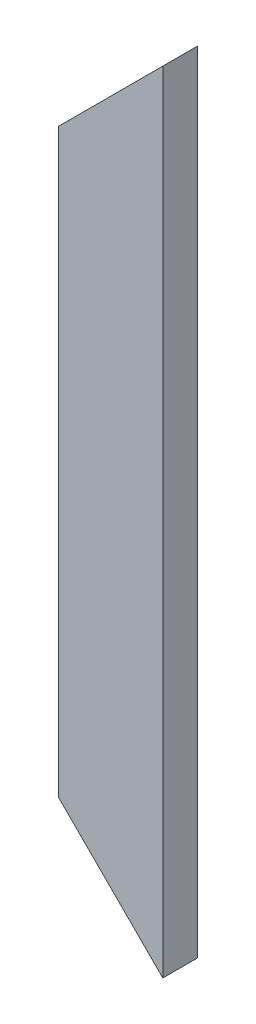
ISO-10303-21;
HEADER;
FILE_DESCRIPTION(('STEP AP214'),'2;1');
FILE_NAME('part.step','',(''),(''),'','','');
FILE_SCHEMA(('AUTOMOTIVE_DESIGN { 1 0 10303 214 1 1 1 1 }'));
ENDSEC;
DATA;
#1=APPLICATION_CONTEXT('core data for automotive mechanical design processes');
#2=APPLICATION_PROTOCOL_DEFINITION('international standard','automotive_design',2000,#1);
#3=PRODUCT_CONTEXT('',#1,'mechanical');
#4=PRODUCT('Part','Part','',(#3));
#5=PRODUCT_RELATED_PRODUCT_CATEGORY('part','',(#4));
#6=PRODUCT_DEFINITION_FORMATION('','',#4);
#7=PRODUCT_DEFINITION_CONTEXT('part definition',#1,'design');
#8=PRODUCT_DEFINITION('design','',#6,#7);
#9=PRODUCT_DEFINITION_SHAPE('','',#8);
#10=(LENGTH_UNIT() NAMED_UNIT(*) SI_UNIT(.MILLI.,.METRE.));
#11=(NAMED_UNIT(*) PLANE_ANGLE_UNIT() SI_UNIT($,.RADIAN.));
#12=(NAMED_UNIT(*) SI_UNIT($,.STERADIAN.) SOLID_ANGLE_UNIT());
#13=UNCERTAINTY_MEASURE_WITH_UNIT(LENGTH_MEASURE(1.E-05),#10,'distance_accuracy_value','');
#14=(GEOMETRIC_REPRESENTATION_CONTEXT(3) GLOBAL_UNCERTAINTY_ASSIGNED_CONTEXT((#13)) GLOBAL_UNIT_ASSIGNED_CONTEXT((#10,
#11,#12)) REPRESENTATION_CONTEXT('',''));
#15=CARTESIAN_POINT('',(0.,0.,0.));
#16=DIRECTION('',(0.,0.,1.));
#17=DIRECTION('',(1.,0.,0.));
#18=AXIS2_PLACEMENT_3D('',#15,#16,#17);
#19=CARTESIAN_POINT('',(-38.1,500.,-12.7));
#20=DIRECTION('',(1.,0.,0.));
#21=DIRECTION('',(0.,0.,-1.));
#22=AXIS2_PLACEMENT_3D('',#19,#20,#21);
#23=PLANE('',#22);
#24=DIRECTION('',(0.,-1.,0.));
#25=VECTOR('',#24,1.);
#26=CARTESIAN_POINT('',(-38.1,500.,12.7));
#27=LINE('',#26,#25);
#28=CARTESIAN_POINT('',(-38.1,461.9,12.7));
#29=VERTEX_POINT('',#28);
#30=CARTESIAN_POINT('',(-38.1,38.1,12.7));
#31=VERTEX_POINT('',#30);
#32=EDGE_CURVE('E11',#29,#31,#27,.T.);
#33=ORIENTED_EDGE('',*,*,#32,.F.);
#34=DIRECTION('',(0.,0.,-1.));
#35=VECTOR('',#34,1.);
#36=CARTESIAN_POINT('',(-38.1,461.9,-12.7));
#37=LINE('',#36,#35);
#38=CARTESIAN_POINT('',(-38.1,461.9,-12.7));
#39=VERTEX_POINT('',#38);
#40=EDGE_CURVE('E153',#29,#39,#37,.T.);
#41=ORIENTED_EDGE('',*,*,#40,.T.);
#42=DIRECTION('',(0.,-1.,0.));
#43=VECTOR('',#42,1.);
#44=CARTESIAN_POINT('',(-38.1,500.,-12.7));
#45=LINE('',#44,#43);
#46=CARTESIAN_POINT('',(-38.1,38.1,-12.7));
#47=VERTEX_POINT('',#46);
#48=EDGE_CURVE('E121',#39,#47,#45,.T.);
#49=ORIENTED_EDGE('',*,*,#48,.T.);
#50=DIRECTION('',(0.,0.,1.));
#51=VECTOR('',#50,1.);
#52=CARTESIAN_POINT('',(-38.1,38.1,-12.6999999999999));
#53=LINE('',#52,#51);
#54=EDGE_CURVE('E112',#47,#31,#53,.T.);
#55=ORIENTED_EDGE('',*,*,#54,.T.);
#56=EDGE_LOOP('',(#33,#41,#49,#55));
#57=FACE_BOUND('',#56,.T.);
#58=ADVANCED_FACE('F36',(#57),#23,.F.);
#59=CARTESIAN_POINT('',(-38.1,500.,12.7));
#60=DIRECTION('',(0.,0.,-1.));
#61=DIRECTION('',(-1.,0.,0.));
#62=AXIS2_PLACEMENT_3D('',#59,#60,#61);
#63=PLANE('',#62);
#64=DIRECTION('',(0.,-1.,0.));
#65=VECTOR('',#64,1.);
#66=CARTESIAN_POINT('',(38.1,500.,12.7));
#67=LINE('',#66,#65);
#68=CARTESIAN_POINT('',(38.1,538.1,12.7));
#69=VERTEX_POINT('',#68);
#70=CARTESIAN_POINT('',(38.1,-38.1,12.7));
#71=VERTEX_POINT('',#70);
#72=EDGE_CURVE('E43',#69,#71,#67,.T.);
#73=ORIENTED_EDGE('',*,*,#72,.F.);
#74=DIRECTION('',(-0.707106781186547,-0.707106781186548,0.));
#75=VECTOR('',#74,1.);
#76=CARTESIAN_POINT('',(-106.109011793753,393.890988206247,12.7));
#77=LINE('',#76,#75);
#78=EDGE_CURVE('E106',#69,#29,#77,.T.);
#79=ORIENTED_EDGE('',*,*,#78,.T.);
#80=ORIENTED_EDGE('',*,*,#32,.T.);
#81=DIRECTION('',(-0.707106781186548,0.707106781186547,0.));
#82=VECTOR('',#81,1.);
#83=CARTESIAN_POINT('',(-62.7726738542055,62.7726738542055,12.7));
#84=LINE('',#83,#82);
#85=EDGE_CURVE('E150',#71,#31,#84,.T.);
#86=ORIENTED_EDGE('',*,*,#85,.F.);
#87=EDGE_LOOP('',(#73,#79,#80,#86));
#88=FACE_BOUND('',#87,.T.);
#89=ADVANCED_FACE('F164',(#88),#63,.F.);
#90=CARTESIAN_POINT('',(38.1,500.,-12.7));
#91=DIRECTION('',(-1.,0.,0.));
#92=DIRECTION('',(0.,0.,1.));
#93=AXIS2_PLACEMENT_3D('',#90,#91,#92);
#94=PLANE('',#93);
#95=ORIENTED_EDGE('',*,*,#72,.T.);
#96=DIRECTION('',(0.,0.,1.));
#97=VECTOR('',#96,1.);
#98=CARTESIAN_POINT('',(38.1,-38.1,-12.7));
#99=LINE('',#98,#97);
#100=CARTESIAN_POINT('',(38.1,-38.1,-12.7));
#101=VERTEX_POINT('',#100);
#102=EDGE_CURVE('E111',#101,#71,#99,.T.);
#103=ORIENTED_EDGE('',*,*,#102,.F.);
#104=DIRECTION('',(0.,-1.,0.));
#105=VECTOR('',#104,1.);
#106=CARTESIAN_POINT('',(38.1,500.,-12.7));
#107=LINE('',#106,#105);
#108=CARTESIAN_POINT('',(38.1,538.1,-12.7));
#109=VERTEX_POINT('',#108);
#110=EDGE_CURVE('E119',#109,#101,#107,.T.);
#111=ORIENTED_EDGE('',*,*,#110,.F.);
#112=DIRECTION('',(0.,0.,-1.));
#113=VECTOR('',#112,1.);
#114=CARTESIAN_POINT('',(38.1,538.1,12.7));
#115=LINE('',#114,#113);
#116=EDGE_CURVE('E100',#69,#109,#115,.T.);
#117=ORIENTED_EDGE('',*,*,#116,.F.);
#118=EDGE_LOOP('',(#95,#103,#111,#117));
#119=FACE_BOUND('',#118,.T.);
#120=ADVANCED_FACE('F123',(#119),#94,.F.);
#121=CARTESIAN_POINT('',(-38.1,500.,-12.7));
#122=DIRECTION('',(0.,0.,1.));
#123=DIRECTION('',(1.,0.,0.));
#124=AXIS2_PLACEMENT_3D('',#121,#122,#123);
#125=PLANE('',#124);
#126=ORIENTED_EDGE('',*,*,#48,.F.);
#127=DIRECTION('',(-0.707106781186547,-0.707106781186548,0.));
#128=VECTOR('',#127,1.);
#129=CARTESIAN_POINT('',(-106.109011793753,393.890988206247,-12.7));
#130=LINE('',#129,#128);
#131=EDGE_CURVE('E103',#109,#39,#130,.T.);
#132=ORIENTED_EDGE('',*,*,#131,.F.);
#133=ORIENTED_EDGE('',*,*,#110,.T.);
#134=DIRECTION('',(-0.707106781186548,0.707106781186547,0.));
#135=VECTOR('',#134,1.);
#136=CARTESIAN_POINT('',(-62.7726738542055,62.7726738542055,-12.7));
#137=LINE('',#136,#135);
#138=EDGE_CURVE('E148',#101,#47,#137,.T.);
#139=ORIENTED_EDGE('',*,*,#138,.T.);
#140=EDGE_LOOP('',(#126,#132,#133,#139));
#141=FACE_BOUND('',#140,.T.);
#142=ADVANCED_FACE('F117',(#141),#125,.F.);
#143=CARTESIAN_POINT('',(-35.052,500.,-9.65199999999999));
#144=DIRECTION('',(1.,0.,0.));
#145=DIRECTION('',(0.,0.,-1.));
#146=AXIS2_PLACEMENT_3D('',#143,#144,#145);
#147=PLANE('',#146);
#148=DIRECTION('',(0.,0.,-1.));
#149=VECTOR('',#148,1.);
#150=CARTESIAN_POINT('',(-35.052,464.948,-9.65199999999999));
#151=LINE('',#150,#149);
#152=CARTESIAN_POINT('',(-35.052,464.948,9.652));
#153=VERTEX_POINT('',#152);
#154=CARTESIAN_POINT('',(-35.052,464.948,-9.65199999999999));
#155=VERTEX_POINT('',#154);
#156=EDGE_CURVE('E50',#153,#155,#151,.T.);
#157=ORIENTED_EDGE('',*,*,#156,.F.);
#158=DIRECTION('',(0.,-1.,0.));
#159=VECTOR('',#158,1.);
#160=CARTESIAN_POINT('',(-35.052,500.,9.652));
#161=LINE('',#160,#159);
#162=CARTESIAN_POINT('',(-35.052,35.0519999999999,9.652));
#163=VERTEX_POINT('',#162);
#164=EDGE_CURVE('E125',#153,#163,#161,.T.);
#165=ORIENTED_EDGE('',*,*,#164,.T.);
#166=DIRECTION('',(0.,0.,1.));
#167=VECTOR('',#166,1.);
#168=CARTESIAN_POINT('',(-35.052,35.052,-9.65199999999999));
#169=LINE('',#168,#167);
#170=CARTESIAN_POINT('',(-35.052,35.0519999999999,-9.65199999999999));
#171=VERTEX_POINT('',#170);
#172=EDGE_CURVE('E137',#171,#163,#169,.T.);
#173=ORIENTED_EDGE('',*,*,#172,.F.);
#174=DIRECTION('',(0.,-1.,0.));
#175=VECTOR('',#174,1.);
#176=CARTESIAN_POINT('',(-35.052,500.,-9.65199999999999));
#177=LINE('',#176,#175);
#178=EDGE_CURVE('E132',#155,#171,#177,.T.);
#179=ORIENTED_EDGE('',*,*,#178,.F.);
#180=EDGE_LOOP('',(#157,#165,#173,#179));
#181=FACE_BOUND('',#180,.T.);
#182=ADVANCED_FACE('F193',(#181),#147,.T.);
#183=CARTESIAN_POINT('',(-35.052,500.,9.652));
#184=DIRECTION('',(0.,0.,-1.));
#185=DIRECTION('',(-1.,0.,0.));
#186=AXIS2_PLACEMENT_3D('',#183,#184,#185);
#187=PLANE('',#186);
#188=DIRECTION('',(-0.707106781186547,-0.707106781186548,0.));
#189=VECTOR('',#188,1.);
#190=CARTESIAN_POINT('',(-17.526,482.474,9.652));
#191=LINE('',#190,#189);
#192=CARTESIAN_POINT('',(35.052,535.052,9.65199999999999));
#193=VERTEX_POINT('',#192);
#194=EDGE_CURVE('E156',#193,#153,#191,.T.);
#195=ORIENTED_EDGE('',*,*,#194,.F.);
#196=DIRECTION('',(0.,-1.,0.));
#197=VECTOR('',#196,1.);
#198=CARTESIAN_POINT('',(35.052,500.,9.65199999999999));
#199=LINE('',#198,#197);
#200=CARTESIAN_POINT('',(35.052,-35.052,9.65199999999999));
#201=VERTEX_POINT('',#200);
#202=EDGE_CURVE('E129',#193,#201,#199,.T.);
#203=ORIENTED_EDGE('',*,*,#202,.T.);
#204=DIRECTION('',(0.707106781186548,-0.707106781186547,0.));
#205=VECTOR('',#204,1.);
#206=CARTESIAN_POINT('',(-267.526,267.526,9.65200000000003));
#207=LINE('',#206,#205);
#208=EDGE_CURVE('E140',#163,#201,#207,.T.);
#209=ORIENTED_EDGE('',*,*,#208,.F.);
#210=ORIENTED_EDGE('',*,*,#164,.F.);
#211=EDGE_LOOP('',(#195,#203,#209,#210));
#212=FACE_BOUND('',#211,.T.);
#213=ADVANCED_FACE('F196',(#212),#187,.T.);
#214=CARTESIAN_POINT('',(35.052,500.,-9.652));
#215=DIRECTION('',(-1.,0.,0.));
#216=DIRECTION('',(0.,0.,1.));
#217=AXIS2_PLACEMENT_3D('',#214,#215,#216);
#218=PLANE('',#217);
#219=DIRECTION('',(0.,0.,1.));
#220=VECTOR('',#219,1.);
#221=CARTESIAN_POINT('',(35.052,535.052,-9.652));
#222=LINE('',#221,#220);
#223=CARTESIAN_POINT('',(35.052,535.052,-9.652));
#224=VERTEX_POINT('',#223);
#225=EDGE_CURVE('E158',#224,#193,#222,.T.);
#226=ORIENTED_EDGE('',*,*,#225,.F.);
#227=DIRECTION('',(0.,-1.,0.));
#228=VECTOR('',#227,1.);
#229=CARTESIAN_POINT('',(35.052,500.,-9.652));
#230=LINE('',#229,#228);
#231=CARTESIAN_POINT('',(35.052,-35.0519999999999,-9.652));
#232=VERTEX_POINT('',#231);
#233=EDGE_CURVE('E58',#224,#232,#230,.T.);
#234=ORIENTED_EDGE('',*,*,#233,.T.);
#235=DIRECTION('',(0.,0.,-1.));
#236=VECTOR('',#235,1.);
#237=CARTESIAN_POINT('',(35.052,-35.052,-9.652));
#238=LINE('',#237,#236);
#239=EDGE_CURVE('E143',#201,#232,#238,.T.);
#240=ORIENTED_EDGE('',*,*,#239,.F.);
#241=ORIENTED_EDGE('',*,*,#202,.F.);
#242=EDGE_LOOP('',(#226,#234,#240,#241));
#243=FACE_BOUND('',#242,.T.);
#244=ADVANCED_FACE('F179',(#243),#218,.T.);
#245=CARTESIAN_POINT('',(-35.052,500.,-9.65199999999999));
#246=DIRECTION('',(0.,0.,1.));
#247=DIRECTION('',(1.,0.,0.));
#248=AXIS2_PLACEMENT_3D('',#245,#246,#247);
#249=PLANE('',#248);
#250=DIRECTION('',(0.707106781186547,0.707106781186548,0.));
#251=VECTOR('',#250,1.);
#252=CARTESIAN_POINT('',(-17.526,482.474,-9.65199999999999));
#253=LINE('',#252,#251);
#254=EDGE_CURVE('E160',#155,#224,#253,.T.);
#255=ORIENTED_EDGE('',*,*,#254,.F.);
#256=ORIENTED_EDGE('',*,*,#178,.T.);
#257=DIRECTION('',(-0.707106781186548,0.707106781186547,0.));
#258=VECTOR('',#257,1.);
#259=CARTESIAN_POINT('',(-267.526,267.526,-9.65199999999996));
#260=LINE('',#259,#258);
#261=EDGE_CURVE('E145',#232,#171,#260,.T.);
#262=ORIENTED_EDGE('',*,*,#261,.F.);
#263=ORIENTED_EDGE('',*,*,#233,.F.);
#264=EDGE_LOOP('',(#255,#256,#262,#263));
#265=FACE_BOUND('',#264,.T.);
#266=ADVANCED_FACE('F171',(#265),#249,.T.);
#267=CARTESIAN_POINT('',(-62.7726738542055,62.7726738542055,-12.7));
#268=DIRECTION('',(0.707106781186547,0.707106781186548,0.));
#269=DIRECTION('',(-0.707106781186548,0.707106781186547,0.));
#270=AXIS2_PLACEMENT_3D('',#267,#268,#269);
#271=PLANE('',#270);
#272=ORIENTED_EDGE('',*,*,#172,.T.);
#273=ORIENTED_EDGE('',*,*,#208,.T.);
#274=ORIENTED_EDGE('',*,*,#239,.T.);
#275=ORIENTED_EDGE('',*,*,#261,.T.);
#276=EDGE_LOOP('',(#272,#273,#274,#275));
#277=FACE_BOUND('',#276,.T.);
#278=ORIENTED_EDGE('',*,*,#138,.F.);
#279=ORIENTED_EDGE('',*,*,#102,.T.);
#280=ORIENTED_EDGE('',*,*,#85,.T.);
#281=ORIENTED_EDGE('',*,*,#54,.F.);
#282=EDGE_LOOP('',(#278,#279,#280,#281));
#283=FACE_BOUND('',#282,.T.);
#284=ADVANCED_FACE('F169',(#277,#283),#271,.F.);
#285=CARTESIAN_POINT('',(-106.109011793753,393.890988206247,12.7));
#286=DIRECTION('',(0.707106781186548,-0.707106781186547,0.));
#287=DIRECTION('',(0.707106781186547,0.707106781186548,0.));
#288=AXIS2_PLACEMENT_3D('',#285,#286,#287);
#289=PLANE('',#288);
#290=ORIENTED_EDGE('',*,*,#156,.T.);
#291=ORIENTED_EDGE('',*,*,#254,.T.);
#292=ORIENTED_EDGE('',*,*,#225,.T.);
#293=ORIENTED_EDGE('',*,*,#194,.T.);
#294=EDGE_LOOP('',(#290,#291,#292,#293));
#295=FACE_BOUND('',#294,.T.);
#296=ORIENTED_EDGE('',*,*,#78,.F.);
#297=ORIENTED_EDGE('',*,*,#116,.T.);
#298=ORIENTED_EDGE('',*,*,#131,.T.);
#299=ORIENTED_EDGE('',*,*,#40,.F.);
#300=EDGE_LOOP('',(#296,#297,#298,#299));
#301=FACE_BOUND('',#300,.T.);
#302=ADVANCED_FACE('F102',(#295,#301),#289,.F.);
#303=CLOSED_SHELL('',(#58,#89,#120,#142,#182,#213,#244,#266,#284,#302));
#304=MANIFOLD_SOLID_BREP('B2',#303);
#305=ADVANCED_BREP_SHAPE_REPRESENTATION('',(#18,#304),#14);
#306=SHAPE_DEFINITION_REPRESENTATION(#9,#305);
ENDSEC;
END-ISO-10303-21;
